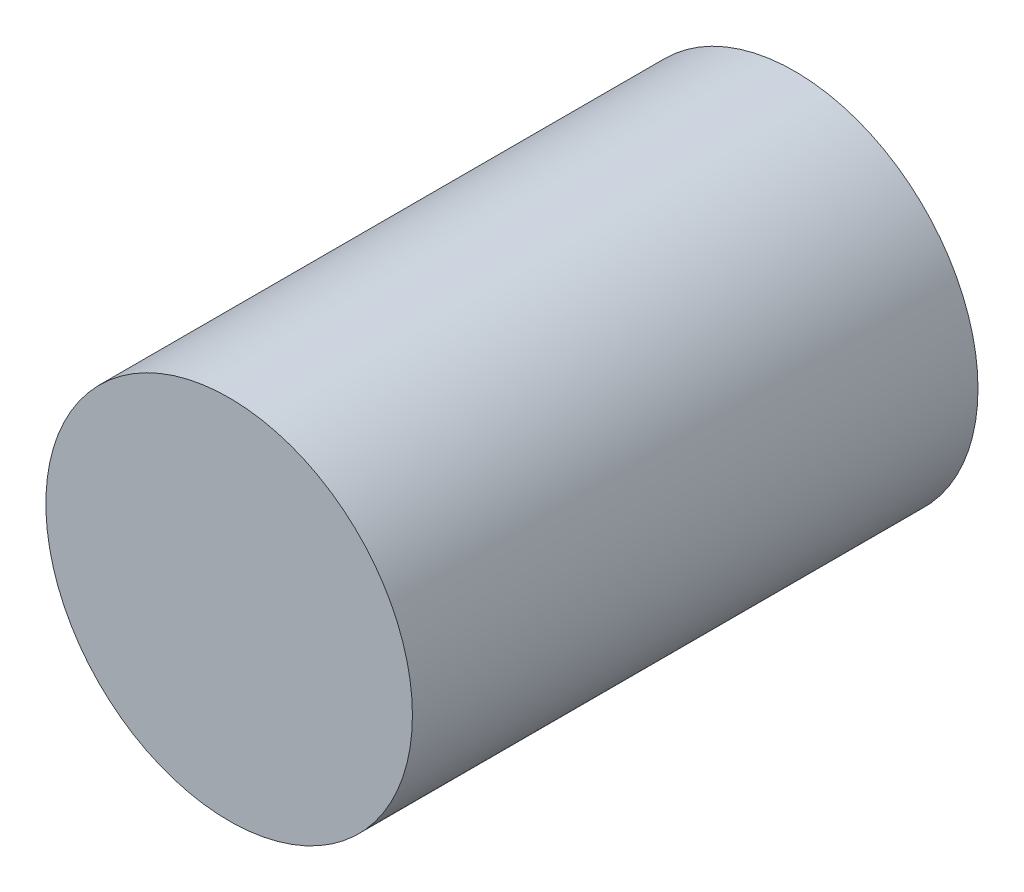
ISO-10303-21;
HEADER;
FILE_DESCRIPTION(('STEP AP214'),'2;1');
FILE_NAME('part.step','',(''),(''),'','','');
FILE_SCHEMA(('AUTOMOTIVE_DESIGN { 1 0 10303 214 1 1 1 1 }'));
ENDSEC;
DATA;
#1=APPLICATION_CONTEXT('core data for automotive mechanical design processes');
#2=APPLICATION_PROTOCOL_DEFINITION('international standard','automotive_design',2000,#1);
#3=PRODUCT_CONTEXT('',#1,'mechanical');
#4=PRODUCT('Part','Part','',(#3));
#5=PRODUCT_RELATED_PRODUCT_CATEGORY('part','',(#4));
#6=PRODUCT_DEFINITION_FORMATION('','',#4);
#7=PRODUCT_DEFINITION_CONTEXT('part definition',#1,'design');
#8=PRODUCT_DEFINITION('design','',#6,#7);
#9=PRODUCT_DEFINITION_SHAPE('','',#8);
#10=(LENGTH_UNIT() NAMED_UNIT(*) SI_UNIT(.MILLI.,.METRE.));
#11=(NAMED_UNIT(*) PLANE_ANGLE_UNIT() SI_UNIT($,.RADIAN.));
#12=(NAMED_UNIT(*) SI_UNIT($,.STERADIAN.) SOLID_ANGLE_UNIT());
#13=UNCERTAINTY_MEASURE_WITH_UNIT(LENGTH_MEASURE(1.E-05),#10,'distance_accuracy_value','');
#14=(GEOMETRIC_REPRESENTATION_CONTEXT(3) GLOBAL_UNCERTAINTY_ASSIGNED_CONTEXT((#13)) GLOBAL_UNIT_ASSIGNED_CONTEXT((#10,
#11,#12)) REPRESENTATION_CONTEXT('',''));
#15=CARTESIAN_POINT('',(0.,0.,0.));
#16=DIRECTION('',(0.,0.,1.));
#17=DIRECTION('',(1.,0.,0.));
#18=AXIS2_PLACEMENT_3D('',#15,#16,#17);
#19=CARTESIAN_POINT('',(0.,0.,50.7492));
#20=DIRECTION('',(0.,0.,-1.));
#21=DIRECTION('',(-1.,0.,0.));
#22=AXIS2_PLACEMENT_3D('',#19,#20,#21);
#23=CYLINDRICAL_SURFACE('',#22,16.4465);
#24=CARTESIAN_POINT('',(0.,0.,50.7492));
#25=DIRECTION('',(0.,0.,1.));
#26=DIRECTION('',(1.,0.,0.));
#27=AXIS2_PLACEMENT_3D('',#24,#25,#26);
#28=CIRCLE('',#27,16.4465);
#29=CARTESIAN_POINT('',(16.4465,0.,50.7492));
#30=VERTEX_POINT('',#29);
#31=EDGE_CURVE('E10',#30,#30,#28,.T.);
#32=ORIENTED_EDGE('',*,*,#31,.F.);
#33=EDGE_LOOP('',(#32));
#34=FACE_BOUND('',#33,.T.);
#35=CARTESIAN_POINT('',(0.,0.,0.));
#36=DIRECTION('',(0.,0.,1.));
#37=DIRECTION('',(1.,0.,0.));
#38=AXIS2_PLACEMENT_3D('',#35,#36,#37);
#39=CIRCLE('',#38,16.4465);
#40=CARTESIAN_POINT('',(16.4465,0.,0.));
#41=VERTEX_POINT('',#40);
#42=EDGE_CURVE('E35',#41,#41,#39,.T.);
#43=ORIENTED_EDGE('',*,*,#42,.T.);
#44=EDGE_LOOP('',(#43));
#45=FACE_BOUND('',#44,.T.);
#46=ADVANCED_FACE('F32',(#34,#45),#23,.T.);
#47=CARTESIAN_POINT('',(0.,0.,50.7492));
#48=DIRECTION('',(0.,0.,1.));
#49=DIRECTION('',(1.,0.,0.));
#50=AXIS2_PLACEMENT_3D('',#47,#48,#49);
#51=PLANE('',#50);
#52=ORIENTED_EDGE('',*,*,#31,.T.);
#53=EDGE_LOOP('',(#52));
#54=FACE_BOUND('',#53,.T.);
#55=ADVANCED_FACE('F47',(#54),#51,.T.);
#56=CARTESIAN_POINT('',(0.,0.,0.));
#57=DIRECTION('',(0.,0.,1.));
#58=DIRECTION('',(1.,0.,0.));
#59=AXIS2_PLACEMENT_3D('',#56,#57,#58);
#60=PLANE('',#59);
#61=ORIENTED_EDGE('',*,*,#42,.F.);
#62=EDGE_LOOP('',(#61));
#63=FACE_BOUND('',#62,.T.);
#64=ADVANCED_FACE('F45',(#63),#60,.F.);
#65=CLOSED_SHELL('',(#46,#55,#64));
#66=MANIFOLD_SOLID_BREP('B2',#65);
#67=ADVANCED_BREP_SHAPE_REPRESENTATION('',(#18,#66),#14);
#68=SHAPE_DEFINITION_REPRESENTATION(#9,#67);
ENDSEC;
END-ISO-10303-21;
